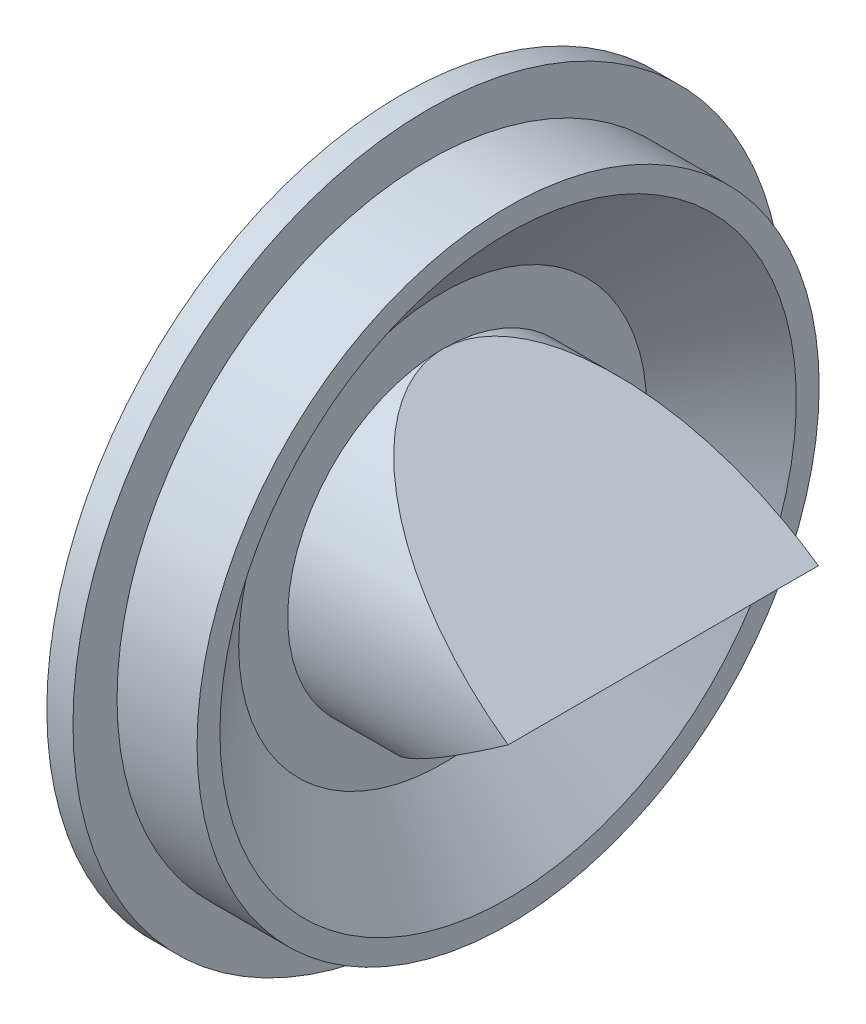
ISO-10303-21;
HEADER;
FILE_DESCRIPTION(('STEP AP214'),'2;1');
FILE_NAME('part.step','',(''),(''),'','','');
FILE_SCHEMA(('AUTOMOTIVE_DESIGN { 1 0 10303 214 1 1 1 1 }'));
ENDSEC;
DATA;
#1=APPLICATION_CONTEXT('core data for automotive mechanical design processes');
#2=APPLICATION_PROTOCOL_DEFINITION('international standard','automotive_design',2000,#1);
#3=PRODUCT_CONTEXT('',#1,'mechanical');
#4=PRODUCT('Part','Part','',(#3));
#5=PRODUCT_RELATED_PRODUCT_CATEGORY('part','',(#4));
#6=PRODUCT_DEFINITION_FORMATION('','',#4);
#7=PRODUCT_DEFINITION_CONTEXT('part definition',#1,'design');
#8=PRODUCT_DEFINITION('design','',#6,#7);
#9=PRODUCT_DEFINITION_SHAPE('','',#8);
#10=(LENGTH_UNIT() NAMED_UNIT(*) SI_UNIT(.MILLI.,.METRE.));
#11=(NAMED_UNIT(*) PLANE_ANGLE_UNIT() SI_UNIT($,.RADIAN.));
#12=(NAMED_UNIT(*) SI_UNIT($,.STERADIAN.) SOLID_ANGLE_UNIT());
#13=UNCERTAINTY_MEASURE_WITH_UNIT(LENGTH_MEASURE(1.E-05),#10,'distance_accuracy_value','');
#14=(GEOMETRIC_REPRESENTATION_CONTEXT(3) GLOBAL_UNCERTAINTY_ASSIGNED_CONTEXT((#13)) GLOBAL_UNIT_ASSIGNED_CONTEXT((#10,
#11,#12)) REPRESENTATION_CONTEXT('',''));
#15=CARTESIAN_POINT('',(0.,0.,0.));
#16=DIRECTION('',(0.,0.,1.));
#17=DIRECTION('',(1.,0.,0.));
#18=AXIS2_PLACEMENT_3D('',#15,#16,#17);
#19=CARTESIAN_POINT('',(0.,0.,0.));
#20=DIRECTION('',(-1.,0.,0.));
#21=DIRECTION('',(0.,0.,1.));
#22=AXIS2_PLACEMENT_3D('',#19,#20,#21);
#23=CYLINDRICAL_SURFACE('',#22,18.75);
#24=CARTESIAN_POINT('',(6.2,0.,0.));
#25=DIRECTION('',(-1.,0.,0.));
#26=DIRECTION('',(0.,0.,1.));
#27=AXIS2_PLACEMENT_3D('',#24,#25,#26);
#28=CIRCLE('',#27,18.75);
#29=CARTESIAN_POINT('',(6.2,0.,18.75));
#30=VERTEX_POINT('',#29);
#31=EDGE_CURVE('E123',#30,#30,#28,.T.);
#32=ORIENTED_EDGE('',*,*,#31,.F.);
#33=EDGE_LOOP('',(#32));
#34=FACE_BOUND('',#33,.T.);
#35=CARTESIAN_POINT('',(0.,0.,0.));
#36=DIRECTION('',(-1.,0.,0.));
#37=DIRECTION('',(0.,0.,1.));
#38=AXIS2_PLACEMENT_3D('',#35,#36,#37);
#39=CIRCLE('',#38,18.75);
#40=CARTESIAN_POINT('',(0.,0.,18.75));
#41=VERTEX_POINT('',#40);
#42=EDGE_CURVE('E94',#41,#41,#39,.T.);
#43=ORIENTED_EDGE('',*,*,#42,.T.);
#44=EDGE_LOOP('',(#43));
#45=FACE_BOUND('',#44,.T.);
#46=ADVANCED_FACE('F36',(#34,#45),#23,.F.);
#47=CARTESIAN_POINT('',(0.,18.75,0.));
#48=DIRECTION('',(1.,0.,0.));
#49=DIRECTION('',(0.,0.,-1.));
#50=AXIS2_PLACEMENT_3D('',#47,#48,#49);
#51=PLANE('',#50);
#52=ORIENTED_EDGE('',*,*,#42,.F.);
#53=EDGE_LOOP('',(#52));
#54=FACE_BOUND('',#53,.T.);
#55=CARTESIAN_POINT('',(0.,0.,0.));
#56=DIRECTION('',(-1.,0.,0.));
#57=DIRECTION('',(0.,0.,1.));
#58=AXIS2_PLACEMENT_3D('',#55,#56,#57);
#59=CIRCLE('',#58,21.75);
#60=CARTESIAN_POINT('',(0.,0.,21.75));
#61=VERTEX_POINT('',#60);
#62=EDGE_CURVE('E101',#61,#61,#59,.T.);
#63=ORIENTED_EDGE('',*,*,#62,.T.);
#64=EDGE_LOOP('',(#63));
#65=FACE_BOUND('',#64,.T.);
#66=ADVANCED_FACE('F145',(#54,#65),#51,.F.);
#67=CARTESIAN_POINT('',(0.,0.,0.));
#68=DIRECTION('',(-1.,0.,0.));
#69=DIRECTION('',(0.,0.,1.));
#70=AXIS2_PLACEMENT_3D('',#67,#68,#69);
#71=CYLINDRICAL_SURFACE('',#70,21.75);
#72=ORIENTED_EDGE('',*,*,#62,.F.);
#73=EDGE_LOOP('',(#72));
#74=FACE_BOUND('',#73,.T.);
#75=CARTESIAN_POINT('',(1.6,0.,0.));
#76=DIRECTION('',(-1.,0.,0.));
#77=DIRECTION('',(0.,0.,1.));
#78=AXIS2_PLACEMENT_3D('',#75,#76,#77);
#79=CIRCLE('',#78,21.75);
#80=CARTESIAN_POINT('',(1.6,0.,21.75));
#81=VERTEX_POINT('',#80);
#82=EDGE_CURVE('E104',#81,#81,#79,.T.);
#83=ORIENTED_EDGE('',*,*,#82,.T.);
#84=EDGE_LOOP('',(#83));
#85=FACE_BOUND('',#84,.T.);
#86=ADVANCED_FACE('F150',(#74,#85),#71,.T.);
#87=CARTESIAN_POINT('',(1.6,21.75,0.));
#88=DIRECTION('',(-1.,0.,0.));
#89=DIRECTION('',(0.,0.,1.));
#90=AXIS2_PLACEMENT_3D('',#87,#88,#89);
#91=PLANE('',#90);
#92=ORIENTED_EDGE('',*,*,#82,.F.);
#93=EDGE_LOOP('',(#92));
#94=FACE_BOUND('',#93,.T.);
#95=CARTESIAN_POINT('',(1.6,0.,0.));
#96=DIRECTION('',(-1.,0.,0.));
#97=DIRECTION('',(0.,0.,1.));
#98=AXIS2_PLACEMENT_3D('',#95,#96,#97);
#99=CIRCLE('',#98,19.05);
#100=CARTESIAN_POINT('',(1.6,0.,19.05));
#101=VERTEX_POINT('',#100);
#102=EDGE_CURVE('E107',#101,#101,#99,.T.);
#103=ORIENTED_EDGE('',*,*,#102,.T.);
#104=EDGE_LOOP('',(#103));
#105=FACE_BOUND('',#104,.T.);
#106=ADVANCED_FACE('F157',(#94,#105),#91,.F.);
#107=CARTESIAN_POINT('',(0.,0.,0.));
#108=DIRECTION('',(-1.,0.,0.));
#109=DIRECTION('',(0.,0.,1.));
#110=AXIS2_PLACEMENT_3D('',#107,#108,#109);
#111=CYLINDRICAL_SURFACE('',#110,19.05);
#112=ORIENTED_EDGE('',*,*,#102,.F.);
#113=EDGE_LOOP('',(#112));
#114=FACE_BOUND('',#113,.T.);
#115=CARTESIAN_POINT('',(6.5,0.,0.));
#116=DIRECTION('',(-1.,0.,0.));
#117=DIRECTION('',(0.,0.,1.));
#118=AXIS2_PLACEMENT_3D('',#115,#116,#117);
#119=CIRCLE('',#118,19.05);
#120=CARTESIAN_POINT('',(6.5,0.,19.05));
#121=VERTEX_POINT('',#120);
#122=EDGE_CURVE('E110',#121,#121,#119,.T.);
#123=ORIENTED_EDGE('',*,*,#122,.T.);
#124=EDGE_LOOP('',(#123));
#125=FACE_BOUND('',#124,.T.);
#126=ADVANCED_FACE('F161',(#114,#125),#111,.T.);
#127=CARTESIAN_POINT('',(6.5,19.05,0.));
#128=DIRECTION('',(-1.,0.,0.));
#129=DIRECTION('',(0.,0.,1.));
#130=AXIS2_PLACEMENT_3D('',#127,#128,#129);
#131=PLANE('',#130);
#132=ORIENTED_EDGE('',*,*,#122,.F.);
#133=EDGE_LOOP('',(#132));
#134=FACE_BOUND('',#133,.T.);
#135=CARTESIAN_POINT('',(6.5,0.,0.));
#136=DIRECTION('',(-1.,0.,0.));
#137=DIRECTION('',(0.,0.,1.));
#138=AXIS2_PLACEMENT_3D('',#135,#136,#137);
#139=CIRCLE('',#138,17.65);
#140=CARTESIAN_POINT('',(6.5,0.,17.65));
#141=VERTEX_POINT('',#140);
#142=EDGE_CURVE('E113',#141,#141,#139,.T.);
#143=ORIENTED_EDGE('',*,*,#142,.T.);
#144=EDGE_LOOP('',(#143));
#145=FACE_BOUND('',#144,.T.);
#146=ADVANCED_FACE('F165',(#134,#145),#131,.F.);
#147=CARTESIAN_POINT('',(2.5,0.,0.));
#148=DIRECTION('',(1.,0.,0.));
#149=DIRECTION('',(0.,0.,-1.));
#150=AXIS2_PLACEMENT_3D('',#147,#148,#149);
#151=CONICAL_SURFACE('',#150,12.5,0.910425652799119);
#152=ORIENTED_EDGE('',*,*,#142,.F.);
#153=EDGE_LOOP('',(#152));
#154=FACE_BOUND('',#153,.T.);
#155=CARTESIAN_POINT('',(2.5,0.,0.));
#156=DIRECTION('',(-1.,0.,0.));
#157=DIRECTION('',(0.,0.,1.));
#158=AXIS2_PLACEMENT_3D('',#155,#156,#157);
#159=CIRCLE('',#158,12.5);
#160=CARTESIAN_POINT('',(2.5,0.,12.5));
#161=VERTEX_POINT('',#160);
#162=EDGE_CURVE('E80',#161,#161,#159,.T.);
#163=ORIENTED_EDGE('',*,*,#162,.T.);
#164=EDGE_LOOP('',(#163));
#165=FACE_BOUND('',#164,.T.);
#166=ADVANCED_FACE('F169',(#154,#165),#151,.F.);
#167=CARTESIAN_POINT('',(2.5,12.5,0.));
#168=DIRECTION('',(-1.,0.,0.));
#169=DIRECTION('',(0.,0.,1.));
#170=AXIS2_PLACEMENT_3D('',#167,#168,#169);
#171=PLANE('',#170);
#172=ORIENTED_EDGE('',*,*,#162,.F.);
#173=EDGE_LOOP('',(#172));
#174=FACE_BOUND('',#173,.T.);
#175=CARTESIAN_POINT('',(2.5,0.,0.));
#176=DIRECTION('',(-1.,0.,0.));
#177=DIRECTION('',(0.,0.,1.));
#178=AXIS2_PLACEMENT_3D('',#175,#176,#177);
#179=CIRCLE('',#178,9.5);
#180=CARTESIAN_POINT('',(2.5,9.5,0.));
#181=VERTEX_POINT('',#180);
#182=CARTESIAN_POINT('',(2.5,-9.5,0.));
#183=VERTEX_POINT('',#182);
#184=EDGE_CURVE('E51',#181,#183,#179,.T.);
#185=ORIENTED_EDGE('',*,*,#184,.T.);
#186=EDGE_CURVE('E69',#183,#181,#179,.T.);
#187=ORIENTED_EDGE('',*,*,#186,.T.);
#188=EDGE_LOOP('',(#185,#187));
#189=FACE_BOUND('',#188,.T.);
#190=ADVANCED_FACE('F70',(#174,#189),#171,.F.);
#191=CARTESIAN_POINT('',(2.2,12.6028195886068,0.));
#192=DIRECTION('',(1.,0.,0.));
#193=DIRECTION('',(0.,0.,-1.));
#194=AXIS2_PLACEMENT_3D('',#191,#192,#193);
#195=PLANE('',#194);
#196=CARTESIAN_POINT('',(2.2,0.,0.));
#197=DIRECTION('',(-1.,0.,0.));
#198=DIRECTION('',(0.,0.,1.));
#199=AXIS2_PLACEMENT_3D('',#196,#197,#198);
#200=CIRCLE('',#199,12.6028195886068);
#201=CARTESIAN_POINT('',(2.2,0.,12.6028195886068));
#202=VERTEX_POINT('',#201);
#203=EDGE_CURVE('E74',#202,#202,#200,.T.);
#204=ORIENTED_EDGE('',*,*,#203,.T.);
#205=EDGE_LOOP('',(#204));
#206=FACE_BOUND('',#205,.T.);
#207=CARTESIAN_POINT('',(2.2,0.,0.));
#208=DIRECTION('',(-1.,0.,0.));
#209=DIRECTION('',(0.,0.,1.));
#210=AXIS2_PLACEMENT_3D('',#207,#208,#209);
#211=CIRCLE('',#210,9.2);
#212=CARTESIAN_POINT('',(2.2,0.,9.2));
#213=VERTEX_POINT('',#212);
#214=EDGE_CURVE('E40',#213,#213,#211,.F.);
#215=ORIENTED_EDGE('',*,*,#214,.T.);
#216=EDGE_LOOP('',(#215));
#217=FACE_BOUND('',#216,.T.);
#218=ADVANCED_FACE('F130',(#206,#217),#195,.F.);
#219=CARTESIAN_POINT('',(6.2,0.,0.));
#220=DIRECTION('',(1.,0.,0.));
#221=DIRECTION('',(0.,0.,-1.));
#222=AXIS2_PLACEMENT_3D('',#219,#220,#221);
#223=CONICAL_SURFACE('',#222,17.7528195886068,0.910425652799119);
#224=ORIENTED_EDGE('',*,*,#203,.F.);
#225=EDGE_LOOP('',(#224));
#226=FACE_BOUND('',#225,.T.);
#227=CARTESIAN_POINT('',(6.2,0.,0.));
#228=DIRECTION('',(-1.,0.,0.));
#229=DIRECTION('',(0.,0.,1.));
#230=AXIS2_PLACEMENT_3D('',#227,#228,#229);
#231=CIRCLE('',#230,17.7528195886068);
#232=CARTESIAN_POINT('',(6.2,0.,17.7528195886068));
#233=VERTEX_POINT('',#232);
#234=EDGE_CURVE('E120',#233,#233,#231,.T.);
#235=ORIENTED_EDGE('',*,*,#234,.T.);
#236=EDGE_LOOP('',(#235));
#237=FACE_BOUND('',#236,.T.);
#238=ADVANCED_FACE('F179',(#226,#237),#223,.T.);
#239=CARTESIAN_POINT('',(6.2,18.75,0.));
#240=DIRECTION('',(1.,0.,0.));
#241=DIRECTION('',(0.,0.,-1.));
#242=AXIS2_PLACEMENT_3D('',#239,#240,#241);
#243=PLANE('',#242);
#244=ORIENTED_EDGE('',*,*,#234,.F.);
#245=EDGE_LOOP('',(#244));
#246=FACE_BOUND('',#245,.T.);
#247=ORIENTED_EDGE('',*,*,#31,.T.);
#248=EDGE_LOOP('',(#247));
#249=FACE_BOUND('',#248,.T.);
#250=ADVANCED_FACE('F183',(#246,#249),#243,.F.);
#251=CARTESIAN_POINT('',(2.5,-9.5,-9.5));
#252=DIRECTION('',(-0.575493406174614,0.817806419300767,0.));
#253=DIRECTION('',(-0.817806419300767,-0.575493406174614,0.));
#254=AXIS2_PLACEMENT_3D('',#251,#252,#253);
#255=PLANE('',#254);
#256=CARTESIAN_POINT('',(16.,0.,0.));
#257=DIRECTION('',(-0.575493406174614,0.817806419300767,0.));
#258=DIRECTION('',(-0.817806419300767,-0.575493406174614,0.));
#259=AXIS2_PLACEMENT_3D('',#256,#257,#258);
#260=ELLIPSE('',#259,16.5075740192192,9.5);
#261=CARTESIAN_POINT('',(16.,0.,9.5));
#262=VERTEX_POINT('',#261);
#263=EDGE_CURVE('E11',#262,#183,#260,.F.);
#264=ORIENTED_EDGE('',*,*,#263,.T.);
#265=CARTESIAN_POINT('',(16.,0.,-9.5));
#266=VERTEX_POINT('',#265);
#267=EDGE_CURVE('E45',#183,#266,#260,.F.);
#268=ORIENTED_EDGE('',*,*,#267,.T.);
#269=DIRECTION('',(0.,0.,1.));
#270=VECTOR('',#269,1.);
#271=CARTESIAN_POINT('',(16.,0.,-9.5));
#272=LINE('',#271,#270);
#273=EDGE_CURVE('E84',#266,#262,#272,.T.);
#274=ORIENTED_EDGE('',*,*,#273,.T.);
#275=EDGE_LOOP('',(#264,#268,#274));
#276=FACE_BOUND('',#275,.T.);
#277=ADVANCED_FACE('F186',(#276),#255,.F.);
#278=CARTESIAN_POINT('',(16.,0.,0.));
#279=DIRECTION('',(-1.,0.,0.));
#280=DIRECTION('',(0.,0.,1.));
#281=AXIS2_PLACEMENT_3D('',#278,#279,#280);
#282=CYLINDRICAL_SURFACE('',#281,9.5);
#283=ORIENTED_EDGE('',*,*,#267,.F.);
#284=ORIENTED_EDGE('',*,*,#184,.F.);
#285=CARTESIAN_POINT('',(16.,0.,0.));
#286=DIRECTION('',(-0.575493406174614,-0.817806419300767,0.));
#287=DIRECTION('',(-0.817806419300767,0.575493406174614,0.));
#288=AXIS2_PLACEMENT_3D('',#285,#286,#287);
#289=ELLIPSE('',#288,16.5075740192192,9.5);
#290=EDGE_CURVE('E78',#266,#181,#289,.F.);
#291=ORIENTED_EDGE('',*,*,#290,.F.);
#292=EDGE_LOOP('',(#283,#284,#291));
#293=FACE_BOUND('',#292,.T.);
#294=ADVANCED_FACE('F38',(#293),#282,.T.);
#295=CARTESIAN_POINT('',(2.5,9.5,-9.5));
#296=DIRECTION('',(-0.575493406174614,-0.817806419300767,0.));
#297=DIRECTION('',(0.817806419300767,-0.575493406174614,0.));
#298=AXIS2_PLACEMENT_3D('',#295,#296,#297);
#299=PLANE('',#298);
#300=ORIENTED_EDGE('',*,*,#290,.T.);
#301=EDGE_CURVE('E81',#181,#262,#289,.F.);
#302=ORIENTED_EDGE('',*,*,#301,.T.);
#303=ORIENTED_EDGE('',*,*,#273,.F.);
#304=EDGE_LOOP('',(#300,#302,#303));
#305=FACE_BOUND('',#304,.T.);
#306=ADVANCED_FACE('F86',(#305),#299,.F.);
#307=ORIENTED_EDGE('',*,*,#301,.F.);
#308=ORIENTED_EDGE('',*,*,#186,.F.);
#309=ORIENTED_EDGE('',*,*,#263,.F.);
#310=EDGE_LOOP('',(#307,#308,#309));
#311=FACE_BOUND('',#310,.T.);
#312=ADVANCED_FACE('F82',(#311),#282,.T.);
#313=CARTESIAN_POINT('',(2.32735197814762,9.25465807420977,-9.5));
#314=DIRECTION('',(-0.575493406174614,-0.817806419300767,0.));
#315=DIRECTION('',(0.817806419300767,-0.575493406174614,0.));
#316=AXIS2_PLACEMENT_3D('',#313,#314,#315);
#317=PLANE('',#316);
#318=CARTESIAN_POINT('',(15.4787081888668,0.,0.));
#319=DIRECTION('',(-0.575493406174614,-0.817806419300767,0.));
#320=DIRECTION('',(-0.817806419300767,0.575493406174614,0.));
#321=AXIS2_PLACEMENT_3D('',#318,#319,#320);
#322=ELLIPSE('',#321,15.9862822080859,9.2);
#323=CARTESIAN_POINT('',(15.4787081888668,0.,-9.2));
#324=VERTEX_POINT('',#323);
#325=CARTESIAN_POINT('',(15.4787081888668,0.,9.2));
#326=VERTEX_POINT('',#325);
#327=EDGE_CURVE('E93',#324,#326,#322,.F.);
#328=ORIENTED_EDGE('',*,*,#327,.F.);
#329=DIRECTION('',(0.,0.,1.));
#330=VECTOR('',#329,1.);
#331=CARTESIAN_POINT('',(15.4787081888668,0.,-9.5));
#332=LINE('',#331,#330);
#333=EDGE_CURVE('E90',#324,#326,#332,.T.);
#334=ORIENTED_EDGE('',*,*,#333,.T.);
#335=EDGE_LOOP('',(#328,#334));
#336=FACE_BOUND('',#335,.T.);
#337=ADVANCED_FACE('F140',(#336),#317,.T.);
#338=CARTESIAN_POINT('',(2.32735197814762,-9.25465807420977,-9.5));
#339=DIRECTION('',(-0.575493406174614,0.817806419300767,0.));
#340=DIRECTION('',(-0.817806419300767,-0.575493406174614,0.));
#341=AXIS2_PLACEMENT_3D('',#338,#339,#340);
#342=PLANE('',#341);
#343=CARTESIAN_POINT('',(15.4787081888668,0.,0.));
#344=DIRECTION('',(-0.575493406174614,0.817806419300767,0.));
#345=DIRECTION('',(-0.817806419300767,-0.575493406174614,0.));
#346=AXIS2_PLACEMENT_3D('',#343,#344,#345);
#347=ELLIPSE('',#346,15.9862822080859,9.2);
#348=EDGE_CURVE('E89',#326,#324,#347,.F.);
#349=ORIENTED_EDGE('',*,*,#348,.F.);
#350=ORIENTED_EDGE('',*,*,#333,.F.);
#351=EDGE_LOOP('',(#349,#350));
#352=FACE_BOUND('',#351,.T.);
#353=ADVANCED_FACE('F134',(#352),#342,.T.);
#354=CARTESIAN_POINT('',(16.,0.,0.));
#355=DIRECTION('',(-1.,0.,0.));
#356=DIRECTION('',(0.,0.,1.));
#357=AXIS2_PLACEMENT_3D('',#354,#355,#356);
#358=CYLINDRICAL_SURFACE('',#357,9.2);
#359=ORIENTED_EDGE('',*,*,#348,.T.);
#360=ORIENTED_EDGE('',*,*,#327,.T.);
#361=EDGE_LOOP('',(#359,#360));
#362=FACE_BOUND('',#361,.T.);
#363=ORIENTED_EDGE('',*,*,#214,.F.);
#364=EDGE_LOOP('',(#363));
#365=FACE_BOUND('',#364,.T.);
#366=ADVANCED_FACE('F132',(#362,#365),#358,.F.);
#367=CLOSED_SHELL('',(#46,#66,#86,#106,#126,#146,#166,#190,#218,#238,#250,#277,#294,#306,#312,
#337,#353,#366));
#368=MANIFOLD_SOLID_BREP('B2',#367);
#369=ADVANCED_BREP_SHAPE_REPRESENTATION('',(#18,#368),#14);
#370=SHAPE_DEFINITION_REPRESENTATION(#9,#369);
ENDSEC;
END-ISO-10303-21;
